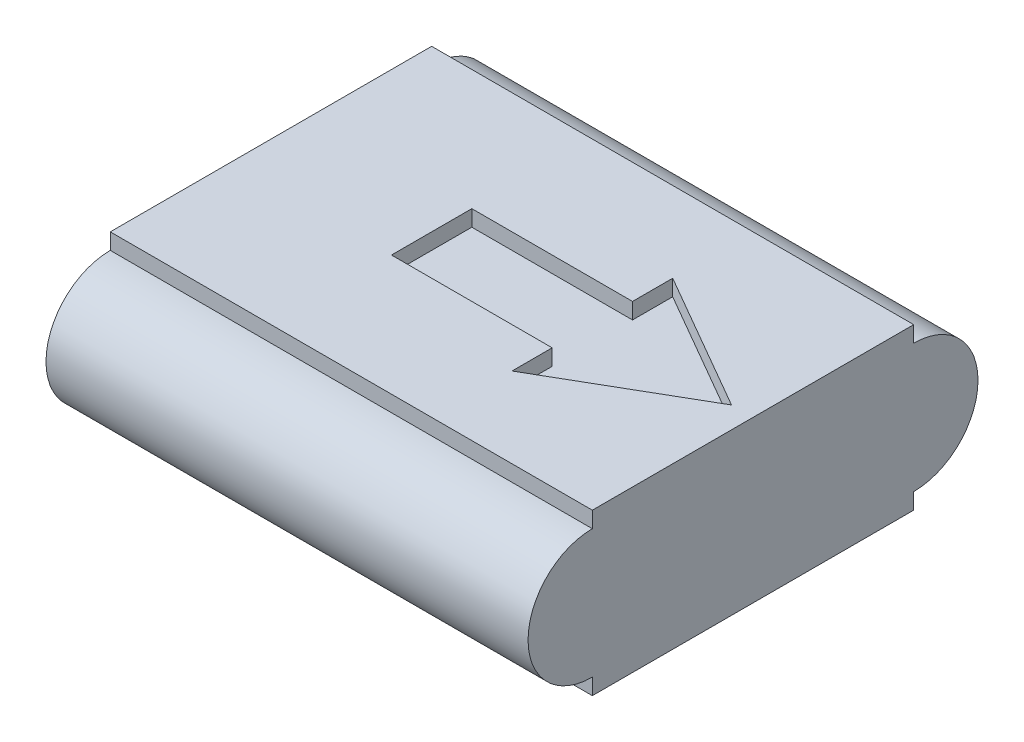
ISO-10303-21;
HEADER;
FILE_DESCRIPTION(('STEP AP214'),'2;1');
FILE_NAME('part.step','',(''),(''),'','','');
FILE_SCHEMA(('AUTOMOTIVE_DESIGN { 1 0 10303 214 1 1 1 1 }'));
ENDSEC;
DATA;
#1=APPLICATION_CONTEXT('core data for automotive mechanical design processes');
#2=APPLICATION_PROTOCOL_DEFINITION('international standard','automotive_design',2000,#1);
#3=PRODUCT_CONTEXT('',#1,'mechanical');
#4=PRODUCT('Part','Part','',(#3));
#5=PRODUCT_RELATED_PRODUCT_CATEGORY('part','',(#4));
#6=PRODUCT_DEFINITION_FORMATION('','',#4);
#7=PRODUCT_DEFINITION_CONTEXT('part definition',#1,'design');
#8=PRODUCT_DEFINITION('design','',#6,#7);
#9=PRODUCT_DEFINITION_SHAPE('','',#8);
#10=(LENGTH_UNIT() NAMED_UNIT(*) SI_UNIT(.MILLI.,.METRE.));
#11=(NAMED_UNIT(*) PLANE_ANGLE_UNIT() SI_UNIT($,.RADIAN.));
#12=(NAMED_UNIT(*) SI_UNIT($,.STERADIAN.) SOLID_ANGLE_UNIT());
#13=UNCERTAINTY_MEASURE_WITH_UNIT(LENGTH_MEASURE(1.E-05),#10,'distance_accuracy_value','');
#14=(GEOMETRIC_REPRESENTATION_CONTEXT(3) GLOBAL_UNCERTAINTY_ASSIGNED_CONTEXT((#13)) GLOBAL_UNIT_ASSIGNED_CONTEXT((#10,
#11,#12)) REPRESENTATION_CONTEXT('',''));
#15=CARTESIAN_POINT('',(0.,0.,0.));
#16=DIRECTION('',(0.,0.,1.));
#17=DIRECTION('',(1.,0.,0.));
#18=AXIS2_PLACEMENT_3D('',#15,#16,#17);
#19=CARTESIAN_POINT('',(150.,100.,-100.));
#20=DIRECTION('',(0.,0.,1.));
#21=DIRECTION('',(1.,0.,0.));
#22=AXIS2_PLACEMENT_3D('',#19,#20,#21);
#23=PLANE('',#22);
#24=DIRECTION('',(0.,-1.,0.));
#25=VECTOR('',#24,1.);
#26=CARTESIAN_POINT('',(150.,100.,-100.));
#27=LINE('',#26,#25);
#28=CARTESIAN_POINT('',(150.,100.,-100.));
#29=VERTEX_POINT('',#28);
#30=CARTESIAN_POINT('',(150.,90.,-100.));
#31=VERTEX_POINT('',#30);
#32=EDGE_CURVE('E59',#29,#31,#27,.T.);
#33=ORIENTED_EDGE('',*,*,#32,.T.);
#34=DIRECTION('',(-1.,0.,0.));
#35=VECTOR('',#34,1.);
#36=CARTESIAN_POINT('',(263.137084989848,90.,-100.));
#37=LINE('',#36,#35);
#38=CARTESIAN_POINT('',(-150.,90.,-100.));
#39=VERTEX_POINT('',#38);
#40=EDGE_CURVE('E11',#31,#39,#37,.T.);
#41=ORIENTED_EDGE('',*,*,#40,.T.);
#42=DIRECTION('',(0.,-1.,0.));
#43=VECTOR('',#42,1.);
#44=CARTESIAN_POINT('',(-150.,100.,-100.));
#45=LINE('',#44,#43);
#46=CARTESIAN_POINT('',(-150.,100.,-100.));
#47=VERTEX_POINT('',#46);
#48=EDGE_CURVE('E245',#47,#39,#45,.T.);
#49=ORIENTED_EDGE('',*,*,#48,.F.);
#50=DIRECTION('',(-1.,0.,0.));
#51=VECTOR('',#50,1.);
#52=CARTESIAN_POINT('',(150.,100.,-100.));
#53=LINE('',#52,#51);
#54=EDGE_CURVE('E232',#29,#47,#53,.T.);
#55=ORIENTED_EDGE('',*,*,#54,.F.);
#56=EDGE_LOOP('',(#33,#41,#49,#55));
#57=FACE_BOUND('',#56,.T.);
#58=ADVANCED_FACE('F37',(#57),#23,.F.);
#59=CARTESIAN_POINT('',(150.,100.,100.));
#60=DIRECTION('',(0.,0.,-1.));
#61=DIRECTION('',(-1.,0.,0.));
#62=AXIS2_PLACEMENT_3D('',#59,#60,#61);
#63=PLANE('',#62);
#64=DIRECTION('',(0.,-1.,0.));
#65=VECTOR('',#64,1.);
#66=CARTESIAN_POINT('',(150.,100.,100.));
#67=LINE('',#66,#65);
#68=CARTESIAN_POINT('',(150.,9.99999999999999,100.));
#69=VERTEX_POINT('',#68);
#70=CARTESIAN_POINT('',(150.,0.,100.));
#71=VERTEX_POINT('',#70);
#72=EDGE_CURVE('E250',#69,#71,#67,.T.);
#73=ORIENTED_EDGE('',*,*,#72,.F.);
#74=DIRECTION('',(-1.,0.,0.));
#75=VECTOR('',#74,1.);
#76=CARTESIAN_POINT('',(263.137084989848,9.99999999999999,99.9999999999999));
#77=LINE('',#76,#75);
#78=CARTESIAN_POINT('',(-150.,9.99999999999999,100.));
#79=VERTEX_POINT('',#78);
#80=EDGE_CURVE('E220',#69,#79,#77,.T.);
#81=ORIENTED_EDGE('',*,*,#80,.T.);
#82=DIRECTION('',(0.,-1.,0.));
#83=VECTOR('',#82,1.);
#84=CARTESIAN_POINT('',(-150.,100.,100.));
#85=LINE('',#84,#83);
#86=CARTESIAN_POINT('',(-150.,0.,100.));
#87=VERTEX_POINT('',#86);
#88=EDGE_CURVE('E254',#79,#87,#85,.T.);
#89=ORIENTED_EDGE('',*,*,#88,.T.);
#90=DIRECTION('',(1.,0.,0.));
#91=VECTOR('',#90,1.);
#92=CARTESIAN_POINT('',(150.,0.,100.));
#93=LINE('',#92,#91);
#94=EDGE_CURVE('E237',#87,#71,#93,.T.);
#95=ORIENTED_EDGE('',*,*,#94,.T.);
#96=EDGE_LOOP('',(#73,#81,#89,#95));
#97=FACE_BOUND('',#96,.T.);
#98=ADVANCED_FACE('F289',(#97),#63,.F.);
#99=CARTESIAN_POINT('',(-150.,100.,100.));
#100=DIRECTION('',(1.,0.,0.));
#101=DIRECTION('',(0.,0.,-1.));
#102=AXIS2_PLACEMENT_3D('',#99,#100,#101);
#103=PLANE('',#102);
#104=ORIENTED_EDGE('',*,*,#48,.T.);
#105=CARTESIAN_POINT('',(-150.,50.,-100.));
#106=DIRECTION('',(-1.,0.,0.));
#107=DIRECTION('',(0.,0.,1.));
#108=AXIS2_PLACEMENT_3D('',#105,#106,#107);
#109=CIRCLE('',#108,40.);
#110=CARTESIAN_POINT('',(-150.,9.99999999999999,-100.));
#111=VERTEX_POINT('',#110);
#112=EDGE_CURVE('E209',#39,#111,#109,.T.);
#113=ORIENTED_EDGE('',*,*,#112,.T.);
#114=CARTESIAN_POINT('',(-150.,0.,-100.));
#115=VERTEX_POINT('',#114);
#116=EDGE_CURVE('E234',#111,#115,#45,.T.);
#117=ORIENTED_EDGE('',*,*,#116,.T.);
#118=DIRECTION('',(0.,0.,1.));
#119=VECTOR('',#118,1.);
#120=CARTESIAN_POINT('',(-150.,0.,100.));
#121=LINE('',#120,#119);
#122=EDGE_CURVE('E223',#115,#87,#121,.T.);
#123=ORIENTED_EDGE('',*,*,#122,.T.);
#124=ORIENTED_EDGE('',*,*,#88,.F.);
#125=CARTESIAN_POINT('',(-150.,50.,100.));
#126=DIRECTION('',(-1.,0.,0.));
#127=DIRECTION('',(0.,0.,1.));
#128=AXIS2_PLACEMENT_3D('',#125,#126,#127);
#129=CIRCLE('',#128,40.);
#130=CARTESIAN_POINT('',(-150.,90.,100.));
#131=VERTEX_POINT('',#130);
#132=EDGE_CURVE('E212',#79,#131,#129,.T.);
#133=ORIENTED_EDGE('',*,*,#132,.T.);
#134=CARTESIAN_POINT('',(-150.,100.,100.));
#135=VERTEX_POINT('',#134);
#136=EDGE_CURVE('E255',#135,#131,#85,.T.);
#137=ORIENTED_EDGE('',*,*,#136,.F.);
#138=DIRECTION('',(0.,0.,1.));
#139=VECTOR('',#138,1.);
#140=CARTESIAN_POINT('',(-150.,100.,100.));
#141=LINE('',#140,#139);
#142=EDGE_CURVE('E224',#47,#135,#141,.T.);
#143=ORIENTED_EDGE('',*,*,#142,.F.);
#144=EDGE_LOOP('',(#104,#113,#117,#123,#124,#133,#137,#143));
#145=FACE_BOUND('',#144,.T.);
#146=ADVANCED_FACE('F39',(#145),#103,.F.);
#147=ORIENTED_EDGE('',*,*,#136,.T.);
#148=DIRECTION('',(-1.,0.,0.));
#149=VECTOR('',#148,1.);
#150=CARTESIAN_POINT('',(263.137084989848,90.,99.9999999999999));
#151=LINE('',#150,#149);
#152=CARTESIAN_POINT('',(150.,90.,100.));
#153=VERTEX_POINT('',#152);
#154=EDGE_CURVE('E217',#131,#153,#151,.F.);
#155=ORIENTED_EDGE('',*,*,#154,.T.);
#156=CARTESIAN_POINT('',(150.,100.,100.));
#157=VERTEX_POINT('',#156);
#158=EDGE_CURVE('E251',#157,#153,#67,.T.);
#159=ORIENTED_EDGE('',*,*,#158,.F.);
#160=DIRECTION('',(1.,0.,0.));
#161=VECTOR('',#160,1.);
#162=CARTESIAN_POINT('',(150.,100.,100.));
#163=LINE('',#162,#161);
#164=EDGE_CURVE('E227',#135,#157,#163,.T.);
#165=ORIENTED_EDGE('',*,*,#164,.F.);
#166=EDGE_LOOP('',(#147,#155,#159,#165));
#167=FACE_BOUND('',#166,.T.);
#168=ADVANCED_FACE('F285',(#167),#63,.F.);
#169=CARTESIAN_POINT('',(150.,100.,100.));
#170=DIRECTION('',(-1.,0.,0.));
#171=DIRECTION('',(0.,0.,1.));
#172=AXIS2_PLACEMENT_3D('',#169,#170,#171);
#173=PLANE('',#172);
#174=CARTESIAN_POINT('',(150.,9.99999999999999,-100.));
#175=VERTEX_POINT('',#174);
#176=CARTESIAN_POINT('',(150.,0.,-100.));
#177=VERTEX_POINT('',#176);
#178=EDGE_CURVE('E248',#175,#177,#27,.T.);
#179=ORIENTED_EDGE('',*,*,#178,.F.);
#180=CARTESIAN_POINT('',(150.,50.,-100.));
#181=DIRECTION('',(-1.,0.,0.));
#182=DIRECTION('',(0.,0.,1.));
#183=AXIS2_PLACEMENT_3D('',#180,#181,#182);
#184=CIRCLE('',#183,40.);
#185=EDGE_CURVE('E197',#175,#31,#184,.F.);
#186=ORIENTED_EDGE('',*,*,#185,.T.);
#187=ORIENTED_EDGE('',*,*,#32,.F.);
#188=DIRECTION('',(0.,0.,-1.));
#189=VECTOR('',#188,1.);
#190=CARTESIAN_POINT('',(150.,100.,100.));
#191=LINE('',#190,#189);
#192=EDGE_CURVE('E230',#157,#29,#191,.T.);
#193=ORIENTED_EDGE('',*,*,#192,.F.);
#194=ORIENTED_EDGE('',*,*,#158,.T.);
#195=CARTESIAN_POINT('',(150.,50.,100.));
#196=DIRECTION('',(-1.,0.,0.));
#197=DIRECTION('',(0.,0.,1.));
#198=AXIS2_PLACEMENT_3D('',#195,#196,#197);
#199=CIRCLE('',#198,40.);
#200=EDGE_CURVE('E215',#153,#69,#199,.F.);
#201=ORIENTED_EDGE('',*,*,#200,.T.);
#202=ORIENTED_EDGE('',*,*,#72,.T.);
#203=DIRECTION('',(0.,0.,-1.));
#204=VECTOR('',#203,1.);
#205=CARTESIAN_POINT('',(150.,0.,100.));
#206=LINE('',#205,#204);
#207=EDGE_CURVE('E240',#71,#177,#206,.T.);
#208=ORIENTED_EDGE('',*,*,#207,.T.);
#209=EDGE_LOOP('',(#179,#186,#187,#193,#194,#201,#202,#208));
#210=FACE_BOUND('',#209,.T.);
#211=ADVANCED_FACE('F266',(#210),#173,.F.);
#212=ORIENTED_EDGE('',*,*,#116,.F.);
#213=DIRECTION('',(-1.,0.,0.));
#214=VECTOR('',#213,1.);
#215=CARTESIAN_POINT('',(263.137084989848,9.99999999999999,-100.));
#216=LINE('',#215,#214);
#217=EDGE_CURVE('E45',#111,#175,#216,.F.);
#218=ORIENTED_EDGE('',*,*,#217,.T.);
#219=ORIENTED_EDGE('',*,*,#178,.T.);
#220=DIRECTION('',(-1.,0.,0.));
#221=VECTOR('',#220,1.);
#222=CARTESIAN_POINT('',(150.,0.,-100.));
#223=LINE('',#222,#221);
#224=EDGE_CURVE('E228',#177,#115,#223,.T.);
#225=ORIENTED_EDGE('',*,*,#224,.T.);
#226=EDGE_LOOP('',(#212,#218,#219,#225));
#227=FACE_BOUND('',#226,.T.);
#228=ADVANCED_FACE('F261',(#227),#23,.F.);
#229=CARTESIAN_POINT('',(0.,100.,0.));
#230=DIRECTION('',(0.,1.,0.));
#231=DIRECTION('',(0.,0.,1.));
#232=AXIS2_PLACEMENT_3D('',#229,#230,#231);
#233=PLANE('',#232);
#234=DIRECTION('',(-1.,0.,0.));
#235=VECTOR('',#234,1.);
#236=CARTESIAN_POINT('',(-50.,100.,-25.));
#237=LINE('',#236,#235);
#238=CARTESIAN_POINT('',(50.,100.,-25.));
#239=VERTEX_POINT('',#238);
#240=CARTESIAN_POINT('',(-50.,100.,-25.));
#241=VERTEX_POINT('',#240);
#242=EDGE_CURVE('E52',#239,#241,#237,.T.);
#243=ORIENTED_EDGE('',*,*,#242,.F.);
#244=DIRECTION('',(0.,0.,1.));
#245=VECTOR('',#244,1.);
#246=CARTESIAN_POINT('',(50.,100.,-25.));
#247=LINE('',#246,#245);
#248=CARTESIAN_POINT('',(50.,100.,-50.0000000000004));
#249=VERTEX_POINT('',#248);
#250=EDGE_CURVE('E165',#249,#239,#247,.T.);
#251=ORIENTED_EDGE('',*,*,#250,.F.);
#252=DIRECTION('',(-0.866025403784436,0.,-0.500000000000004));
#253=VECTOR('',#252,1.);
#254=CARTESIAN_POINT('',(50.,100.,-50.0000000000004));
#255=LINE('',#254,#253);
#256=CARTESIAN_POINT('',(136.602540378444,100.,0.));
#257=VERTEX_POINT('',#256);
#258=EDGE_CURVE('E168',#257,#249,#255,.T.);
#259=ORIENTED_EDGE('',*,*,#258,.F.);
#260=DIRECTION('',(0.866025403784436,0.,-0.500000000000004));
#261=VECTOR('',#260,1.);
#262=CARTESIAN_POINT('',(136.602540378444,100.,0.));
#263=LINE('',#262,#261);
#264=CARTESIAN_POINT('',(50.,100.,50.0000000000004));
#265=VERTEX_POINT('',#264);
#266=EDGE_CURVE('E190',#265,#257,#263,.T.);
#267=ORIENTED_EDGE('',*,*,#266,.F.);
#268=DIRECTION('',(0.,0.,1.));
#269=VECTOR('',#268,1.);
#270=CARTESIAN_POINT('',(50.,100.,50.0000000000004));
#271=LINE('',#270,#269);
#272=CARTESIAN_POINT('',(50.,100.,25.));
#273=VERTEX_POINT('',#272);
#274=EDGE_CURVE('E187',#273,#265,#271,.T.);
#275=ORIENTED_EDGE('',*,*,#274,.F.);
#276=DIRECTION('',(1.,0.,0.));
#277=VECTOR('',#276,1.);
#278=CARTESIAN_POINT('',(50.,100.,25.));
#279=LINE('',#278,#277);
#280=CARTESIAN_POINT('',(-50.,100.,25.));
#281=VERTEX_POINT('',#280);
#282=EDGE_CURVE('E184',#281,#273,#279,.T.);
#283=ORIENTED_EDGE('',*,*,#282,.F.);
#284=DIRECTION('',(0.,0.,1.));
#285=VECTOR('',#284,1.);
#286=CARTESIAN_POINT('',(-50.,100.,25.));
#287=LINE('',#286,#285);
#288=EDGE_CURVE('E182',#241,#281,#287,.T.);
#289=ORIENTED_EDGE('',*,*,#288,.F.);
#290=EDGE_LOOP('',(#243,#251,#259,#267,#275,#283,#289));
#291=FACE_BOUND('',#290,.T.);
#292=ORIENTED_EDGE('',*,*,#142,.T.);
#293=ORIENTED_EDGE('',*,*,#164,.T.);
#294=ORIENTED_EDGE('',*,*,#192,.T.);
#295=ORIENTED_EDGE('',*,*,#54,.T.);
#296=EDGE_LOOP('',(#292,#293,#294,#295));
#297=FACE_BOUND('',#296,.T.);
#298=ADVANCED_FACE('F281',(#291,#297),#233,.T.);
#299=CARTESIAN_POINT('',(0.,0.,0.));
#300=DIRECTION('',(0.,1.,0.));
#301=DIRECTION('',(0.,0.,1.));
#302=AXIS2_PLACEMENT_3D('',#299,#300,#301);
#303=PLANE('',#302);
#304=ORIENTED_EDGE('',*,*,#122,.F.);
#305=ORIENTED_EDGE('',*,*,#224,.F.);
#306=ORIENTED_EDGE('',*,*,#207,.F.);
#307=ORIENTED_EDGE('',*,*,#94,.F.);
#308=EDGE_LOOP('',(#304,#305,#306,#307));
#309=FACE_BOUND('',#308,.T.);
#310=ADVANCED_FACE('F274',(#309),#303,.F.);
#311=CARTESIAN_POINT('',(263.137084989848,50.,100.));
#312=DIRECTION('',(-1.,0.,0.));
#313=DIRECTION('',(0.,0.,1.));
#314=AXIS2_PLACEMENT_3D('',#311,#312,#313);
#315=CYLINDRICAL_SURFACE('',#314,40.);
#316=ORIENTED_EDGE('',*,*,#80,.F.);
#317=ORIENTED_EDGE('',*,*,#200,.F.);
#318=ORIENTED_EDGE('',*,*,#154,.F.);
#319=ORIENTED_EDGE('',*,*,#132,.F.);
#320=EDGE_LOOP('',(#316,#317,#318,#319));
#321=FACE_BOUND('',#320,.T.);
#322=ADVANCED_FACE('F287',(#321),#315,.T.);
#323=CARTESIAN_POINT('',(263.137084989848,50.,-100.));
#324=DIRECTION('',(-1.,0.,0.));
#325=DIRECTION('',(0.,0.,1.));
#326=AXIS2_PLACEMENT_3D('',#323,#324,#325);
#327=CYLINDRICAL_SURFACE('',#326,40.);
#328=ORIENTED_EDGE('',*,*,#40,.F.);
#329=ORIENTED_EDGE('',*,*,#185,.F.);
#330=ORIENTED_EDGE('',*,*,#217,.F.);
#331=ORIENTED_EDGE('',*,*,#112,.F.);
#332=EDGE_LOOP('',(#328,#329,#330,#331));
#333=FACE_BOUND('',#332,.T.);
#334=ADVANCED_FACE('F264',(#333),#327,.T.);
#335=CARTESIAN_POINT('',(-50.,90.,-25.));
#336=DIRECTION('',(0.,0.,-1.));
#337=DIRECTION('',(-1.,0.,0.));
#338=AXIS2_PLACEMENT_3D('',#335,#336,#337);
#339=PLANE('',#338);
#340=ORIENTED_EDGE('',*,*,#242,.T.);
#341=DIRECTION('',(0.,1.,0.));
#342=VECTOR('',#341,1.);
#343=CARTESIAN_POINT('',(-50.,90.,-25.));
#344=LINE('',#343,#342);
#345=CARTESIAN_POINT('',(-50.,90.,-25.));
#346=VERTEX_POINT('',#345);
#347=EDGE_CURVE('E142',#346,#241,#344,.T.);
#348=ORIENTED_EDGE('',*,*,#347,.F.);
#349=DIRECTION('',(-1.,0.,0.));
#350=VECTOR('',#349,1.);
#351=CARTESIAN_POINT('',(-50.,90.,-25.));
#352=LINE('',#351,#350);
#353=CARTESIAN_POINT('',(50.,90.,-25.));
#354=VERTEX_POINT('',#353);
#355=EDGE_CURVE('E146',#354,#346,#352,.T.);
#356=ORIENTED_EDGE('',*,*,#355,.F.);
#357=DIRECTION('',(0.,1.,0.));
#358=VECTOR('',#357,1.);
#359=CARTESIAN_POINT('',(50.,90.,-25.));
#360=LINE('',#359,#358);
#361=EDGE_CURVE('E195',#354,#239,#360,.T.);
#362=ORIENTED_EDGE('',*,*,#361,.T.);
#363=EDGE_LOOP('',(#340,#348,#356,#362));
#364=FACE_BOUND('',#363,.T.);
#365=ADVANCED_FACE('F144',(#364),#339,.F.);
#366=CARTESIAN_POINT('',(50.,90.,-25.));
#367=DIRECTION('',(-1.,0.,0.));
#368=DIRECTION('',(0.,0.,1.));
#369=AXIS2_PLACEMENT_3D('',#366,#367,#368);
#370=PLANE('',#369);
#371=ORIENTED_EDGE('',*,*,#250,.T.);
#372=ORIENTED_EDGE('',*,*,#361,.F.);
#373=DIRECTION('',(0.,0.,1.));
#374=VECTOR('',#373,1.);
#375=CARTESIAN_POINT('',(50.,90.,-25.));
#376=LINE('',#375,#374);
#377=CARTESIAN_POINT('',(50.,90.,-50.0000000000004));
#378=VERTEX_POINT('',#377);
#379=EDGE_CURVE('E152',#378,#354,#376,.T.);
#380=ORIENTED_EDGE('',*,*,#379,.F.);
#381=DIRECTION('',(0.,1.,0.));
#382=VECTOR('',#381,1.);
#383=CARTESIAN_POINT('',(50.,90.,-50.0000000000004));
#384=LINE('',#383,#382);
#385=EDGE_CURVE('E198',#378,#249,#384,.T.);
#386=ORIENTED_EDGE('',*,*,#385,.T.);
#387=EDGE_LOOP('',(#371,#372,#380,#386));
#388=FACE_BOUND('',#387,.T.);
#389=ADVANCED_FACE('F316',(#388),#370,.F.);
#390=CARTESIAN_POINT('',(50.,90.,-50.0000000000004));
#391=DIRECTION('',(0.500000000000004,0.,-0.866025403784436));
#392=DIRECTION('',(-0.866025403784436,0.,-0.500000000000004));
#393=AXIS2_PLACEMENT_3D('',#390,#391,#392);
#394=PLANE('',#393);
#395=ORIENTED_EDGE('',*,*,#258,.T.);
#396=ORIENTED_EDGE('',*,*,#385,.F.);
#397=DIRECTION('',(-0.866025403784436,0.,-0.500000000000004));
#398=VECTOR('',#397,1.);
#399=CARTESIAN_POINT('',(50.,90.,-50.0000000000004));
#400=LINE('',#399,#398);
#401=CARTESIAN_POINT('',(136.602540378444,90.,0.));
#402=VERTEX_POINT('',#401);
#403=EDGE_CURVE('E178',#402,#378,#400,.T.);
#404=ORIENTED_EDGE('',*,*,#403,.F.);
#405=DIRECTION('',(0.,1.,0.));
#406=VECTOR('',#405,1.);
#407=CARTESIAN_POINT('',(136.602540378444,90.,0.));
#408=LINE('',#407,#406);
#409=EDGE_CURVE('E200',#402,#257,#408,.T.);
#410=ORIENTED_EDGE('',*,*,#409,.T.);
#411=EDGE_LOOP('',(#395,#396,#404,#410));
#412=FACE_BOUND('',#411,.T.);
#413=ADVANCED_FACE('F330',(#412),#394,.F.);
#414=CARTESIAN_POINT('',(136.602540378444,90.,0.));
#415=DIRECTION('',(0.500000000000004,0.,0.866025403784436));
#416=DIRECTION('',(0.866025403784436,0.,-0.500000000000004));
#417=AXIS2_PLACEMENT_3D('',#414,#415,#416);
#418=PLANE('',#417);
#419=ORIENTED_EDGE('',*,*,#266,.T.);
#420=ORIENTED_EDGE('',*,*,#409,.F.);
#421=DIRECTION('',(0.866025403784436,0.,-0.500000000000004));
#422=VECTOR('',#421,1.);
#423=CARTESIAN_POINT('',(136.602540378444,90.,0.));
#424=LINE('',#423,#422);
#425=CARTESIAN_POINT('',(50.,90.,50.0000000000004));
#426=VERTEX_POINT('',#425);
#427=EDGE_CURVE('E175',#426,#402,#424,.T.);
#428=ORIENTED_EDGE('',*,*,#427,.F.);
#429=DIRECTION('',(0.,1.,0.));
#430=VECTOR('',#429,1.);
#431=CARTESIAN_POINT('',(50.,90.,50.0000000000004));
#432=LINE('',#431,#430);
#433=EDGE_CURVE('E202',#426,#265,#432,.T.);
#434=ORIENTED_EDGE('',*,*,#433,.T.);
#435=EDGE_LOOP('',(#419,#420,#428,#434));
#436=FACE_BOUND('',#435,.T.);
#437=ADVANCED_FACE('F326',(#436),#418,.F.);
#438=CARTESIAN_POINT('',(50.,90.,50.0000000000004));
#439=DIRECTION('',(-1.,0.,0.));
#440=DIRECTION('',(0.,0.,1.));
#441=AXIS2_PLACEMENT_3D('',#438,#439,#440);
#442=PLANE('',#441);
#443=ORIENTED_EDGE('',*,*,#274,.T.);
#444=ORIENTED_EDGE('',*,*,#433,.F.);
#445=DIRECTION('',(0.,0.,1.));
#446=VECTOR('',#445,1.);
#447=CARTESIAN_POINT('',(50.,90.,50.0000000000004));
#448=LINE('',#447,#446);
#449=CARTESIAN_POINT('',(50.,90.,25.));
#450=VERTEX_POINT('',#449);
#451=EDGE_CURVE('E172',#450,#426,#448,.T.);
#452=ORIENTED_EDGE('',*,*,#451,.F.);
#453=DIRECTION('',(0.,1.,0.));
#454=VECTOR('',#453,1.);
#455=CARTESIAN_POINT('',(50.,90.,25.));
#456=LINE('',#455,#454);
#457=EDGE_CURVE('E204',#450,#273,#456,.T.);
#458=ORIENTED_EDGE('',*,*,#457,.T.);
#459=EDGE_LOOP('',(#443,#444,#452,#458));
#460=FACE_BOUND('',#459,.T.);
#461=ADVANCED_FACE('F322',(#460),#442,.F.);
#462=CARTESIAN_POINT('',(50.,90.,25.));
#463=DIRECTION('',(0.,0.,1.));
#464=DIRECTION('',(1.,0.,0.));
#465=AXIS2_PLACEMENT_3D('',#462,#463,#464);
#466=PLANE('',#465);
#467=ORIENTED_EDGE('',*,*,#282,.T.);
#468=ORIENTED_EDGE('',*,*,#457,.F.);
#469=DIRECTION('',(1.,0.,0.));
#470=VECTOR('',#469,1.);
#471=CARTESIAN_POINT('',(50.,90.,25.));
#472=LINE('',#471,#470);
#473=CARTESIAN_POINT('',(-50.,90.,25.));
#474=VERTEX_POINT('',#473);
#475=EDGE_CURVE('E160',#474,#450,#472,.T.);
#476=ORIENTED_EDGE('',*,*,#475,.F.);
#477=DIRECTION('',(0.,1.,0.));
#478=VECTOR('',#477,1.);
#479=CARTESIAN_POINT('',(-50.,90.,25.));
#480=LINE('',#479,#478);
#481=EDGE_CURVE('E151',#474,#281,#480,.T.);
#482=ORIENTED_EDGE('',*,*,#481,.T.);
#483=EDGE_LOOP('',(#467,#468,#476,#482));
#484=FACE_BOUND('',#483,.T.);
#485=ADVANCED_FACE('F319',(#484),#466,.F.);
#486=CARTESIAN_POINT('',(-50.,90.,25.));
#487=DIRECTION('',(-1.,0.,0.));
#488=DIRECTION('',(0.,0.,1.));
#489=AXIS2_PLACEMENT_3D('',#486,#487,#488);
#490=PLANE('',#489);
#491=ORIENTED_EDGE('',*,*,#288,.T.);
#492=ORIENTED_EDGE('',*,*,#481,.F.);
#493=DIRECTION('',(0.,0.,1.));
#494=VECTOR('',#493,1.);
#495=CARTESIAN_POINT('',(-50.,90.,25.));
#496=LINE('',#495,#494);
#497=EDGE_CURVE('E155',#346,#474,#496,.T.);
#498=ORIENTED_EDGE('',*,*,#497,.F.);
#499=ORIENTED_EDGE('',*,*,#347,.T.);
#500=EDGE_LOOP('',(#491,#492,#498,#499));
#501=FACE_BOUND('',#500,.T.);
#502=ADVANCED_FACE('F156',(#501),#490,.F.);
#503=CARTESIAN_POINT('',(0.,90.,0.));
#504=DIRECTION('',(0.,1.,0.));
#505=DIRECTION('',(0.,0.,1.));
#506=AXIS2_PLACEMENT_3D('',#503,#504,#505);
#507=PLANE('',#506);
#508=ORIENTED_EDGE('',*,*,#355,.T.);
#509=ORIENTED_EDGE('',*,*,#497,.T.);
#510=ORIENTED_EDGE('',*,*,#475,.T.);
#511=ORIENTED_EDGE('',*,*,#451,.T.);
#512=ORIENTED_EDGE('',*,*,#427,.T.);
#513=ORIENTED_EDGE('',*,*,#403,.T.);
#514=ORIENTED_EDGE('',*,*,#379,.T.);
#515=EDGE_LOOP('',(#508,#509,#510,#511,#512,#513,#514));
#516=FACE_BOUND('',#515,.T.);
#517=ADVANCED_FACE('F162',(#516),#507,.T.);
#518=CLOSED_SHELL('',(#58,#98,#146,#168,#211,#228,#298,#310,#322,#334,#365,#389,#413,#437,#461,
#485,#502,#517));
#519=MANIFOLD_SOLID_BREP('B2',#518);
#520=ADVANCED_BREP_SHAPE_REPRESENTATION('',(#18,#519),#14);
#521=SHAPE_DEFINITION_REPRESENTATION(#9,#520);
ENDSEC;
END-ISO-10303-21;
